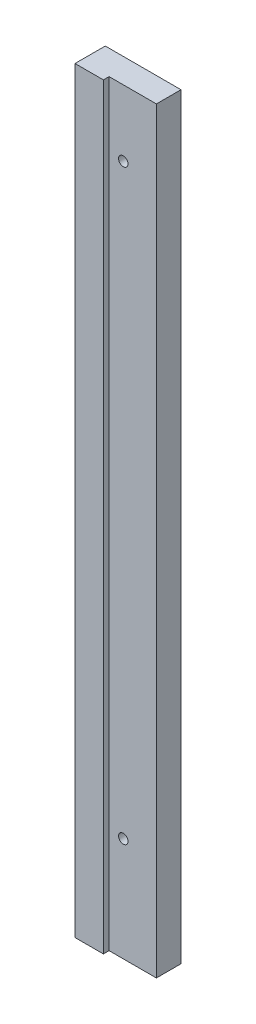
ISO-10303-21;
HEADER;
FILE_DESCRIPTION(('STEP AP214'),'2;1');
FILE_NAME('part.step','',(''),(''),'','','');
FILE_SCHEMA(('AUTOMOTIVE_DESIGN { 1 0 10303 214 1 1 1 1 }'));
ENDSEC;
DATA;
#1=APPLICATION_CONTEXT('core data for automotive mechanical design processes');
#2=APPLICATION_PROTOCOL_DEFINITION('international standard','automotive_design',2000,#1);
#3=PRODUCT_CONTEXT('',#1,'mechanical');
#4=PRODUCT('Part','Part','',(#3));
#5=PRODUCT_RELATED_PRODUCT_CATEGORY('part','',(#4));
#6=PRODUCT_DEFINITION_FORMATION('','',#4);
#7=PRODUCT_DEFINITION_CONTEXT('part definition',#1,'design');
#8=PRODUCT_DEFINITION('design','',#6,#7);
#9=PRODUCT_DEFINITION_SHAPE('','',#8);
#10=(LENGTH_UNIT() NAMED_UNIT(*) SI_UNIT(.MILLI.,.METRE.));
#11=(NAMED_UNIT(*) PLANE_ANGLE_UNIT() SI_UNIT($,.RADIAN.));
#12=(NAMED_UNIT(*) SI_UNIT($,.STERADIAN.) SOLID_ANGLE_UNIT());
#13=UNCERTAINTY_MEASURE_WITH_UNIT(LENGTH_MEASURE(1.E-05),#10,'distance_accuracy_value','');
#14=(GEOMETRIC_REPRESENTATION_CONTEXT(3) GLOBAL_UNCERTAINTY_ASSIGNED_CONTEXT((#13)) GLOBAL_UNIT_ASSIGNED_CONTEXT((#10,
#11,#12)) REPRESENTATION_CONTEXT('',''));
#15=CARTESIAN_POINT('',(0.,0.,0.));
#16=DIRECTION('',(0.,0.,1.));
#17=DIRECTION('',(1.,0.,0.));
#18=AXIS2_PLACEMENT_3D('',#15,#16,#17);
#19=CARTESIAN_POINT('',(20.,200.,16.));
#20=DIRECTION('',(-1.,0.,0.));
#21=DIRECTION('',(0.,-1.,0.));
#22=AXIS2_PLACEMENT_3D('',#19,#20,#21);
#23=PLANE('',#22);
#24=DIRECTION('',(0.,0.,-1.));
#25=VECTOR('',#24,1.);
#26=CARTESIAN_POINT('',(20.,200.,16.));
#27=LINE('',#26,#25);
#28=CARTESIAN_POINT('',(19.9999999999997,200.,13.));
#29=VERTEX_POINT('',#28);
#30=CARTESIAN_POINT('',(20.,200.,0.));
#31=VERTEX_POINT('',#30);
#32=EDGE_CURVE('E11',#29,#31,#27,.T.);
#33=ORIENTED_EDGE('',*,*,#32,.F.);
#34=DIRECTION('',(0.,-1.,0.));
#35=VECTOR('',#34,1.);
#36=CARTESIAN_POINT('',(19.9999999999997,200.001,13.));
#37=LINE('',#36,#35);
#38=CARTESIAN_POINT('',(20.,-200.,13.));
#39=VERTEX_POINT('',#38);
#40=EDGE_CURVE('E89',#29,#39,#37,.T.);
#41=ORIENTED_EDGE('',*,*,#40,.T.);
#42=DIRECTION('',(0.,0.,-1.));
#43=VECTOR('',#42,1.);
#44=CARTESIAN_POINT('',(20.,-200.,16.));
#45=LINE('',#44,#43);
#46=CARTESIAN_POINT('',(20.,-200.,0.));
#47=VERTEX_POINT('',#46);
#48=EDGE_CURVE('E82',#39,#47,#45,.T.);
#49=ORIENTED_EDGE('',*,*,#48,.T.);
#50=DIRECTION('',(0.,1.,0.));
#51=VECTOR('',#50,1.);
#52=CARTESIAN_POINT('',(20.,200.,0.));
#53=LINE('',#52,#51);
#54=EDGE_CURVE('E86',#47,#31,#53,.T.);
#55=ORIENTED_EDGE('',*,*,#54,.T.);
#56=EDGE_LOOP('',(#33,#41,#49,#55));
#57=FACE_BOUND('',#56,.T.);
#58=ADVANCED_FACE('F39',(#57),#23,.F.);
#59=CARTESIAN_POINT('',(-20.,200.,16.));
#60=DIRECTION('',(0.,-1.,0.));
#61=DIRECTION('',(0.,0.,-1.));
#62=AXIS2_PLACEMENT_3D('',#59,#60,#61);
#63=PLANE('',#62);
#64=DIRECTION('',(-1.,0.,0.));
#65=VECTOR('',#64,1.);
#66=CARTESIAN_POINT('',(-20.,200.,16.));
#67=LINE('',#66,#65);
#68=CARTESIAN_POINT('',(-5.00000000000029,200.,16.));
#69=VERTEX_POINT('',#68);
#70=CARTESIAN_POINT('',(-20.,200.,16.));
#71=VERTEX_POINT('',#70);
#72=EDGE_CURVE('E102',#69,#71,#67,.T.);
#73=ORIENTED_EDGE('',*,*,#72,.F.);
#74=DIRECTION('',(0.,0.,1.));
#75=VECTOR('',#74,1.);
#76=CARTESIAN_POINT('',(-5.00000000000029,200.,16.));
#77=LINE('',#76,#75);
#78=CARTESIAN_POINT('',(-5.00000000000029,200.,13.));
#79=VERTEX_POINT('',#78);
#80=EDGE_CURVE('E54',#79,#69,#77,.T.);
#81=ORIENTED_EDGE('',*,*,#80,.F.);
#82=DIRECTION('',(-1.,0.,0.));
#83=VECTOR('',#82,1.);
#84=CARTESIAN_POINT('',(-5.00000000000029,200.,13.));
#85=LINE('',#84,#83);
#86=EDGE_CURVE('E108',#29,#79,#85,.T.);
#87=ORIENTED_EDGE('',*,*,#86,.F.);
#88=ORIENTED_EDGE('',*,*,#32,.T.);
#89=DIRECTION('',(-1.,0.,0.));
#90=VECTOR('',#89,1.);
#91=CARTESIAN_POINT('',(-20.,200.,0.));
#92=LINE('',#91,#90);
#93=CARTESIAN_POINT('',(-20.,200.,0.));
#94=VERTEX_POINT('',#93);
#95=EDGE_CURVE('E107',#31,#94,#92,.T.);
#96=ORIENTED_EDGE('',*,*,#95,.T.);
#97=DIRECTION('',(0.,0.,-1.));
#98=VECTOR('',#97,1.);
#99=CARTESIAN_POINT('',(-20.,200.,16.));
#100=LINE('',#99,#98);
#101=EDGE_CURVE('E47',#71,#94,#100,.T.);
#102=ORIENTED_EDGE('',*,*,#101,.F.);
#103=EDGE_LOOP('',(#73,#81,#87,#88,#96,#102));
#104=FACE_BOUND('',#103,.T.);
#105=ADVANCED_FACE('F125',(#104),#63,.F.);
#106=CARTESIAN_POINT('',(-20.,200.,16.));
#107=DIRECTION('',(1.,0.,0.));
#108=DIRECTION('',(0.,1.,0.));
#109=AXIS2_PLACEMENT_3D('',#106,#107,#108);
#110=PLANE('',#109);
#111=DIRECTION('',(0.,-1.,0.));
#112=VECTOR('',#111,1.);
#113=CARTESIAN_POINT('',(-20.,200.,0.));
#114=LINE('',#113,#112);
#115=CARTESIAN_POINT('',(-20.,-200.,0.));
#116=VERTEX_POINT('',#115);
#117=EDGE_CURVE('E103',#94,#116,#114,.T.);
#118=ORIENTED_EDGE('',*,*,#117,.T.);
#119=DIRECTION('',(0.,0.,-1.));
#120=VECTOR('',#119,1.);
#121=CARTESIAN_POINT('',(-20.,-200.,16.));
#122=LINE('',#121,#120);
#123=CARTESIAN_POINT('',(-20.,-200.,16.));
#124=VERTEX_POINT('',#123);
#125=EDGE_CURVE('E92',#124,#116,#122,.T.);
#126=ORIENTED_EDGE('',*,*,#125,.F.);
#127=DIRECTION('',(0.,-1.,0.));
#128=VECTOR('',#127,1.);
#129=CARTESIAN_POINT('',(-20.,200.,16.));
#130=LINE('',#129,#128);
#131=EDGE_CURVE('E63',#71,#124,#130,.T.);
#132=ORIENTED_EDGE('',*,*,#131,.F.);
#133=ORIENTED_EDGE('',*,*,#101,.T.);
#134=EDGE_LOOP('',(#118,#126,#132,#133));
#135=FACE_BOUND('',#134,.T.);
#136=ADVANCED_FACE('F122',(#135),#110,.F.);
#137=CARTESIAN_POINT('',(-20.,-200.,16.));
#138=DIRECTION('',(0.,1.,0.));
#139=DIRECTION('',(0.,0.,1.));
#140=AXIS2_PLACEMENT_3D('',#137,#138,#139);
#141=PLANE('',#140);
#142=DIRECTION('',(1.,0.,0.));
#143=VECTOR('',#142,1.);
#144=CARTESIAN_POINT('',(-4.99999999999998,-200.,13.));
#145=LINE('',#144,#143);
#146=CARTESIAN_POINT('',(-4.99999999999998,-200.,13.));
#147=VERTEX_POINT('',#146);
#148=EDGE_CURVE('E142',#147,#39,#145,.T.);
#149=ORIENTED_EDGE('',*,*,#148,.F.);
#150=DIRECTION('',(0.,0.,-1.));
#151=VECTOR('',#150,1.);
#152=CARTESIAN_POINT('',(-4.99999999999998,-200.,16.));
#153=LINE('',#152,#151);
#154=CARTESIAN_POINT('',(-4.99999999999998,-200.,16.));
#155=VERTEX_POINT('',#154);
#156=EDGE_CURVE('E141',#155,#147,#153,.T.);
#157=ORIENTED_EDGE('',*,*,#156,.F.);
#158=DIRECTION('',(1.,0.,0.));
#159=VECTOR('',#158,1.);
#160=CARTESIAN_POINT('',(-20.,-200.,16.));
#161=LINE('',#160,#159);
#162=EDGE_CURVE('E93',#124,#155,#161,.T.);
#163=ORIENTED_EDGE('',*,*,#162,.F.);
#164=ORIENTED_EDGE('',*,*,#125,.T.);
#165=DIRECTION('',(1.,0.,0.));
#166=VECTOR('',#165,1.);
#167=CARTESIAN_POINT('',(-20.,-200.,0.));
#168=LINE('',#167,#166);
#169=EDGE_CURVE('E97',#116,#47,#168,.T.);
#170=ORIENTED_EDGE('',*,*,#169,.T.);
#171=ORIENTED_EDGE('',*,*,#48,.F.);
#172=EDGE_LOOP('',(#149,#157,#163,#164,#170,#171));
#173=FACE_BOUND('',#172,.T.);
#174=ADVANCED_FACE('F98',(#173),#141,.F.);
#175=CARTESIAN_POINT('',(0.,0.,16.));
#176=DIRECTION('',(0.,0.,1.));
#177=DIRECTION('',(1.,0.,0.));
#178=AXIS2_PLACEMENT_3D('',#175,#176,#177);
#179=PLANE('',#178);
#180=DIRECTION('',(0.,-1.,0.));
#181=VECTOR('',#180,1.);
#182=CARTESIAN_POINT('',(-5.00000000000029,200.001,16.));
#183=LINE('',#182,#181);
#184=EDGE_CURVE('E112',#69,#155,#183,.T.);
#185=ORIENTED_EDGE('',*,*,#184,.F.);
#186=ORIENTED_EDGE('',*,*,#72,.T.);
#187=ORIENTED_EDGE('',*,*,#131,.T.);
#188=ORIENTED_EDGE('',*,*,#162,.T.);
#189=EDGE_LOOP('',(#185,#186,#187,#188));
#190=FACE_BOUND('',#189,.T.);
#191=ADVANCED_FACE('F156',(#190),#179,.T.);
#192=CARTESIAN_POINT('',(0.,0.,0.));
#193=DIRECTION('',(0.,0.,1.));
#194=DIRECTION('',(1.,0.,0.));
#195=AXIS2_PLACEMENT_3D('',#192,#193,#194);
#196=PLANE('',#195);
#197=CARTESIAN_POINT('',(2.50000000000244,164.999999999997,0.));
#198=DIRECTION('',(0.,0.,-1.));
#199=DIRECTION('',(-1.,0.,0.));
#200=AXIS2_PLACEMENT_3D('',#197,#198,#199);
#201=CIRCLE('',#200,2.5);
#202=CARTESIAN_POINT('',(2.44682746286529E-12,164.999999999997,0.));
#203=VERTEX_POINT('',#202);
#204=EDGE_CURVE('E249',#203,#203,#201,.T.);
#205=ORIENTED_EDGE('',*,*,#204,.F.);
#206=EDGE_LOOP('',(#205));
#207=FACE_BOUND('',#206,.T.);
#208=CARTESIAN_POINT('',(2.50000000000011,-145.,0.));
#209=DIRECTION('',(0.,0.,-1.));
#210=DIRECTION('',(-1.,0.,0.));
#211=AXIS2_PLACEMENT_3D('',#208,#209,#210);
#212=CIRCLE('',#211,2.5);
#213=CARTESIAN_POINT('',(1.15359111152458E-13,-145.,0.));
#214=VERTEX_POINT('',#213);
#215=EDGE_CURVE('E149',#214,#214,#212,.T.);
#216=ORIENTED_EDGE('',*,*,#215,.F.);
#217=EDGE_LOOP('',(#216));
#218=FACE_BOUND('',#217,.T.);
#219=ORIENTED_EDGE('',*,*,#54,.F.);
#220=ORIENTED_EDGE('',*,*,#169,.F.);
#221=ORIENTED_EDGE('',*,*,#117,.F.);
#222=ORIENTED_EDGE('',*,*,#95,.F.);
#223=EDGE_LOOP('',(#219,#220,#221,#222));
#224=FACE_BOUND('',#223,.T.);
#225=ADVANCED_FACE('F106',(#207,#218,#224),#196,.F.);
#226=CARTESIAN_POINT('',(-5.00000000000029,200.001,16.));
#227=DIRECTION('',(-1.,0.,0.));
#228=DIRECTION('',(0.,-1.,0.));
#229=AXIS2_PLACEMENT_3D('',#226,#227,#228);
#230=PLANE('',#229);
#231=ORIENTED_EDGE('',*,*,#80,.T.);
#232=ORIENTED_EDGE('',*,*,#184,.T.);
#233=ORIENTED_EDGE('',*,*,#156,.T.);
#234=DIRECTION('',(0.,-1.,0.));
#235=VECTOR('',#234,1.);
#236=CARTESIAN_POINT('',(-5.00000000000029,200.001,13.));
#237=LINE('',#236,#235);
#238=EDGE_CURVE('E138',#79,#147,#237,.T.);
#239=ORIENTED_EDGE('',*,*,#238,.F.);
#240=EDGE_LOOP('',(#231,#232,#233,#239));
#241=FACE_BOUND('',#240,.T.);
#242=ADVANCED_FACE('F139',(#241),#230,.F.);
#243=CARTESIAN_POINT('',(-5.00000000000029,200.001,13.));
#244=DIRECTION('',(0.,0.,-1.));
#245=DIRECTION('',(-1.,0.,0.));
#246=AXIS2_PLACEMENT_3D('',#243,#244,#245);
#247=PLANE('',#246);
#248=CARTESIAN_POINT('',(2.50000000000244,164.999999999997,13.));
#249=DIRECTION('',(0.,0.,-1.));
#250=DIRECTION('',(-1.,0.,0.));
#251=AXIS2_PLACEMENT_3D('',#248,#249,#250);
#252=CIRCLE('',#251,2.5);
#253=CARTESIAN_POINT('',(2.44812850547227E-12,164.999999999997,13.));
#254=VERTEX_POINT('',#253);
#255=EDGE_CURVE('E42',#254,#254,#252,.T.);
#256=ORIENTED_EDGE('',*,*,#255,.T.);
#257=EDGE_LOOP('',(#256));
#258=FACE_BOUND('',#257,.T.);
#259=CARTESIAN_POINT('',(2.50000000000011,-145.,13.));
#260=DIRECTION('',(0.,0.,-1.));
#261=DIRECTION('',(-1.,0.,0.));
#262=AXIS2_PLACEMENT_3D('',#259,#260,#261);
#263=CIRCLE('',#262,2.5);
#264=CARTESIAN_POINT('',(1.1666015375944E-13,-145.,13.));
#265=VERTEX_POINT('',#264);
#266=EDGE_CURVE('E145',#265,#265,#263,.T.);
#267=ORIENTED_EDGE('',*,*,#266,.T.);
#268=EDGE_LOOP('',(#267));
#269=FACE_BOUND('',#268,.T.);
#270=ORIENTED_EDGE('',*,*,#86,.T.);
#271=ORIENTED_EDGE('',*,*,#238,.T.);
#272=ORIENTED_EDGE('',*,*,#148,.T.);
#273=ORIENTED_EDGE('',*,*,#40,.F.);
#274=EDGE_LOOP('',(#270,#271,#272,#273));
#275=FACE_BOUND('',#274,.T.);
#276=ADVANCED_FACE('F144',(#258,#269,#275),#247,.F.);
#277=CARTESIAN_POINT('',(2.50000000000011,-145.,0.));
#278=DIRECTION('',(0.,0.,-1.));
#279=DIRECTION('',(-1.,0.,0.));
#280=AXIS2_PLACEMENT_3D('',#277,#278,#279);
#281=CYLINDRICAL_SURFACE('',#280,2.5);
#282=ORIENTED_EDGE('',*,*,#215,.T.);
#283=EDGE_LOOP('',(#282));
#284=FACE_BOUND('',#283,.T.);
#285=ORIENTED_EDGE('',*,*,#266,.F.);
#286=EDGE_LOOP('',(#285));
#287=FACE_BOUND('',#286,.T.);
#288=ADVANCED_FACE('F214',(#284,#287),#281,.F.);
#289=CARTESIAN_POINT('',(2.50000000000244,164.999999999997,0.));
#290=DIRECTION('',(0.,0.,-1.));
#291=DIRECTION('',(-1.,0.,0.));
#292=AXIS2_PLACEMENT_3D('',#289,#290,#291);
#293=CYLINDRICAL_SURFACE('',#292,2.5);
#294=ORIENTED_EDGE('',*,*,#204,.T.);
#295=EDGE_LOOP('',(#294));
#296=FACE_BOUND('',#295,.T.);
#297=ORIENTED_EDGE('',*,*,#255,.F.);
#298=EDGE_LOOP('',(#297));
#299=FACE_BOUND('',#298,.T.);
#300=ADVANCED_FACE('F225',(#296,#299),#293,.F.);
#301=CLOSED_SHELL('',(#58,#105,#136,#174,#191,#225,#242,#276,#288,#300));
#302=MANIFOLD_SOLID_BREP('B2',#301);
#303=ADVANCED_BREP_SHAPE_REPRESENTATION('',(#18,#302),#14);
#304=SHAPE_DEFINITION_REPRESENTATION(#9,#303);
ENDSEC;
END-ISO-10303-21;
